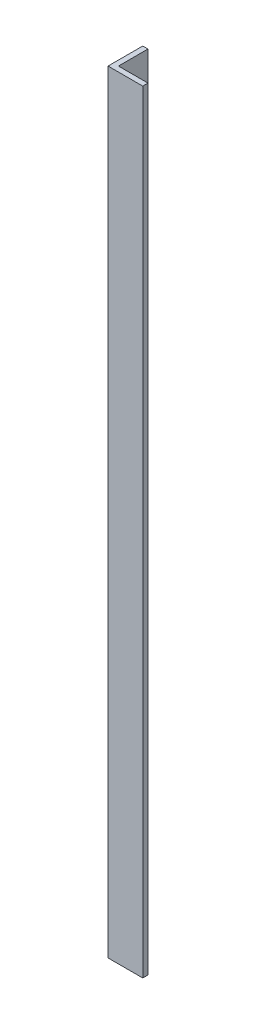
ISO-10303-21;
HEADER;
FILE_DESCRIPTION(('STEP AP214'),'2;1');
FILE_NAME('part.step','',(''),(''),'','','');
FILE_SCHEMA(('AUTOMOTIVE_DESIGN { 1 0 10303 214 1 1 1 1 }'));
ENDSEC;
DATA;
#1=APPLICATION_CONTEXT('core data for automotive mechanical design processes');
#2=APPLICATION_PROTOCOL_DEFINITION('international standard','automotive_design',2000,#1);
#3=PRODUCT_CONTEXT('',#1,'mechanical');
#4=PRODUCT('Part','Part','',(#3));
#5=PRODUCT_RELATED_PRODUCT_CATEGORY('part','',(#4));
#6=PRODUCT_DEFINITION_FORMATION('','',#4);
#7=PRODUCT_DEFINITION_CONTEXT('part definition',#1,'design');
#8=PRODUCT_DEFINITION('design','',#6,#7);
#9=PRODUCT_DEFINITION_SHAPE('','',#8);
#10=(LENGTH_UNIT() NAMED_UNIT(*) SI_UNIT(.MILLI.,.METRE.));
#11=(NAMED_UNIT(*) PLANE_ANGLE_UNIT() SI_UNIT($,.RADIAN.));
#12=(NAMED_UNIT(*) SI_UNIT($,.STERADIAN.) SOLID_ANGLE_UNIT());
#13=UNCERTAINTY_MEASURE_WITH_UNIT(LENGTH_MEASURE(1.E-05),#10,'distance_accuracy_value','');
#14=(GEOMETRIC_REPRESENTATION_CONTEXT(3) GLOBAL_UNCERTAINTY_ASSIGNED_CONTEXT((#13)) GLOBAL_UNIT_ASSIGNED_CONTEXT((#10,
#11,#12)) REPRESENTATION_CONTEXT('',''));
#15=CARTESIAN_POINT('',(0.,0.,0.));
#16=DIRECTION('',(0.,0.,1.));
#17=DIRECTION('',(1.,0.,0.));
#18=AXIS2_PLACEMENT_3D('',#15,#16,#17);
#19=CARTESIAN_POINT('',(0.,1130.3,-2.44249065417534E-12));
#20=DIRECTION('',(0.,0.,-1.));
#21=DIRECTION('',(-1.,0.,0.));
#22=AXIS2_PLACEMENT_3D('',#19,#20,#21);
#23=PLANE('',#22);
#24=DIRECTION('',(1.,0.,0.));
#25=VECTOR('',#24,1.);
#26=CARTESIAN_POINT('',(0.,0.,0.));
#27=LINE('',#26,#25);
#28=CARTESIAN_POINT('',(0.,0.,0.));
#29=VERTEX_POINT('',#28);
#30=CARTESIAN_POINT('',(50.8000000000002,0.,0.));
#31=VERTEX_POINT('',#30);
#32=EDGE_CURVE('E118',#29,#31,#27,.T.);
#33=ORIENTED_EDGE('',*,*,#32,.T.);
#34=DIRECTION('',(0.,-0.999999999999997,0.));
#35=VECTOR('',#34,1.);
#36=CARTESIAN_POINT('',(50.8000000000002,1130.3,-2.44249065417534E-12));
#37=LINE('',#36,#35);
#38=CARTESIAN_POINT('',(50.8000000000002,1130.3,-2.44249065417534E-12));
#39=VERTEX_POINT('',#38);
#40=EDGE_CURVE('E11',#39,#31,#37,.T.);
#41=ORIENTED_EDGE('',*,*,#40,.F.);
#42=DIRECTION('',(1.,0.,0.));
#43=VECTOR('',#42,1.);
#44=CARTESIAN_POINT('',(0.,1130.3,-2.44249065417534E-12));
#45=LINE('',#44,#43);
#46=CARTESIAN_POINT('',(0.,1130.3,-2.44249065417534E-12));
#47=VERTEX_POINT('',#46);
#48=EDGE_CURVE('E128',#47,#39,#45,.T.);
#49=ORIENTED_EDGE('',*,*,#48,.F.);
#50=DIRECTION('',(0.,-0.999999999999997,0.));
#51=VECTOR('',#50,1.);
#52=CARTESIAN_POINT('',(0.,1130.3,-2.44249065417534E-12));
#53=LINE('',#52,#51);
#54=EDGE_CURVE('E114',#47,#29,#53,.T.);
#55=ORIENTED_EDGE('',*,*,#54,.T.);
#56=EDGE_LOOP('',(#33,#41,#49,#55));
#57=FACE_BOUND('',#56,.T.);
#58=ADVANCED_FACE('F34',(#57),#23,.F.);
#59=CARTESIAN_POINT('',(50.8000000000002,1130.3,-2.44249065417534E-12));
#60=DIRECTION('',(-1.,0.,0.));
#61=DIRECTION('',(0.,0.,1.));
#62=AXIS2_PLACEMENT_3D('',#59,#60,#61);
#63=PLANE('',#62);
#64=DIRECTION('',(0.,0.,-1.));
#65=VECTOR('',#64,1.);
#66=CARTESIAN_POINT('',(50.8000000000002,0.,0.));
#67=LINE('',#66,#65);
#68=CARTESIAN_POINT('',(50.8000000000002,0.,-7.62000000000018));
#69=VERTEX_POINT('',#68);
#70=EDGE_CURVE('E121',#31,#69,#67,.T.);
#71=ORIENTED_EDGE('',*,*,#70,.T.);
#72=DIRECTION('',(0.,-0.999999999999997,0.));
#73=VECTOR('',#72,1.);
#74=CARTESIAN_POINT('',(50.8000000000002,1130.3,-7.62000000000262));
#75=LINE('',#74,#73);
#76=CARTESIAN_POINT('',(50.8000000000002,1130.3,-7.62000000000262));
#77=VERTEX_POINT('',#76);
#78=EDGE_CURVE('E42',#77,#69,#75,.T.);
#79=ORIENTED_EDGE('',*,*,#78,.F.);
#80=DIRECTION('',(0.,0.,-1.));
#81=VECTOR('',#80,1.);
#82=CARTESIAN_POINT('',(50.8000000000002,1130.3,-2.44249065417534E-12));
#83=LINE('',#82,#81);
#84=EDGE_CURVE('E87',#39,#77,#83,.T.);
#85=ORIENTED_EDGE('',*,*,#84,.F.);
#86=ORIENTED_EDGE('',*,*,#40,.T.);
#87=EDGE_LOOP('',(#71,#79,#85,#86));
#88=FACE_BOUND('',#87,.T.);
#89=ADVANCED_FACE('F152',(#88),#63,.F.);
#90=CARTESIAN_POINT('',(7.62000000000018,1130.3,-7.62000000000262));
#91=DIRECTION('',(0.,0.,1.));
#92=DIRECTION('',(1.,0.,0.));
#93=AXIS2_PLACEMENT_3D('',#90,#91,#92);
#94=PLANE('',#93);
#95=DIRECTION('',(-1.,0.,0.));
#96=VECTOR('',#95,1.);
#97=CARTESIAN_POINT('',(7.62000000000018,0.,-7.62000000000018));
#98=LINE('',#97,#96);
#99=CARTESIAN_POINT('',(7.62000000000018,0.,-7.62000000000018));
#100=VERTEX_POINT('',#99);
#101=EDGE_CURVE('E123',#69,#100,#98,.T.);
#102=ORIENTED_EDGE('',*,*,#101,.T.);
#103=DIRECTION('',(0.,-0.999999999999997,0.));
#104=VECTOR('',#103,1.);
#105=CARTESIAN_POINT('',(7.62000000000018,1130.3,-7.62000000000262));
#106=LINE('',#105,#104);
#107=CARTESIAN_POINT('',(7.62000000000018,1130.3,-7.62000000000262));
#108=VERTEX_POINT('',#107);
#109=EDGE_CURVE('E109',#108,#100,#106,.T.);
#110=ORIENTED_EDGE('',*,*,#109,.F.);
#111=DIRECTION('',(-1.,0.,0.));
#112=VECTOR('',#111,1.);
#113=CARTESIAN_POINT('',(7.62000000000018,1130.3,-7.62000000000262));
#114=LINE('',#113,#112);
#115=EDGE_CURVE('E100',#77,#108,#114,.T.);
#116=ORIENTED_EDGE('',*,*,#115,.F.);
#117=ORIENTED_EDGE('',*,*,#78,.T.);
#118=EDGE_LOOP('',(#102,#110,#116,#117));
#119=FACE_BOUND('',#118,.T.);
#120=ADVANCED_FACE('F134',(#119),#94,.F.);
#121=CARTESIAN_POINT('',(7.62000000000018,1130.3,-7.62000000000262));
#122=DIRECTION('',(-1.,0.,0.));
#123=DIRECTION('',(0.,0.,1.));
#124=AXIS2_PLACEMENT_3D('',#121,#122,#123);
#125=PLANE('',#124);
#126=DIRECTION('',(0.,0.,-1.));
#127=VECTOR('',#126,1.);
#128=CARTESIAN_POINT('',(7.62000000000018,0.,-7.62000000000018));
#129=LINE('',#128,#127);
#130=CARTESIAN_POINT('',(7.62000000000018,0.,-50.8000000000002));
#131=VERTEX_POINT('',#130);
#132=EDGE_CURVE('E108',#100,#131,#129,.T.);
#133=ORIENTED_EDGE('',*,*,#132,.T.);
#134=DIRECTION('',(0.,-0.999999999999997,0.));
#135=VECTOR('',#134,1.);
#136=CARTESIAN_POINT('',(7.62000000000018,1130.3,-50.8000000000026));
#137=LINE('',#136,#135);
#138=CARTESIAN_POINT('',(7.62000000000018,1130.3,-50.8000000000026));
#139=VERTEX_POINT('',#138);
#140=EDGE_CURVE('E105',#139,#131,#137,.T.);
#141=ORIENTED_EDGE('',*,*,#140,.F.);
#142=DIRECTION('',(0.,0.,-1.));
#143=VECTOR('',#142,1.);
#144=CARTESIAN_POINT('',(7.62000000000018,1130.3,-7.62000000000262));
#145=LINE('',#144,#143);
#146=EDGE_CURVE('E94',#108,#139,#145,.T.);
#147=ORIENTED_EDGE('',*,*,#146,.F.);
#148=ORIENTED_EDGE('',*,*,#109,.T.);
#149=EDGE_LOOP('',(#133,#141,#147,#148));
#150=FACE_BOUND('',#149,.T.);
#151=ADVANCED_FACE('F106',(#150),#125,.F.);
#152=CARTESIAN_POINT('',(0.,1130.3,-50.8000000000026));
#153=DIRECTION('',(0.,0.,1.));
#154=DIRECTION('',(1.,0.,0.));
#155=AXIS2_PLACEMENT_3D('',#152,#153,#154);
#156=PLANE('',#155);
#157=DIRECTION('',(-1.,0.,0.));
#158=VECTOR('',#157,1.);
#159=CARTESIAN_POINT('',(0.,0.,-50.8000000000002));
#160=LINE('',#159,#158);
#161=CARTESIAN_POINT('',(0.,0.,-50.8000000000002));
#162=VERTEX_POINT('',#161);
#163=EDGE_CURVE('E73',#131,#162,#160,.T.);
#164=ORIENTED_EDGE('',*,*,#163,.T.);
#165=DIRECTION('',(0.,-0.999999999999997,0.));
#166=VECTOR('',#165,1.);
#167=CARTESIAN_POINT('',(0.,1130.3,-50.8000000000026));
#168=LINE('',#167,#166);
#169=CARTESIAN_POINT('',(0.,1130.3,-50.8000000000026));
#170=VERTEX_POINT('',#169);
#171=EDGE_CURVE('E110',#170,#162,#168,.T.);
#172=ORIENTED_EDGE('',*,*,#171,.F.);
#173=DIRECTION('',(-1.,0.,0.));
#174=VECTOR('',#173,1.);
#175=CARTESIAN_POINT('',(0.,1130.3,-50.8000000000026));
#176=LINE('',#175,#174);
#177=EDGE_CURVE('E98',#139,#170,#176,.T.);
#178=ORIENTED_EDGE('',*,*,#177,.F.);
#179=ORIENTED_EDGE('',*,*,#140,.T.);
#180=EDGE_LOOP('',(#164,#172,#178,#179));
#181=FACE_BOUND('',#180,.T.);
#182=ADVANCED_FACE('F112',(#181),#156,.F.);
#183=CARTESIAN_POINT('',(0.,1130.3,-2.44249065417534E-12));
#184=DIRECTION('',(1.,0.,0.));
#185=DIRECTION('',(0.,0.,-1.));
#186=AXIS2_PLACEMENT_3D('',#183,#184,#185);
#187=PLANE('',#186);
#188=DIRECTION('',(0.,0.,1.));
#189=VECTOR('',#188,1.);
#190=CARTESIAN_POINT('',(0.,0.,0.));
#191=LINE('',#190,#189);
#192=EDGE_CURVE('E79',#162,#29,#191,.T.);
#193=ORIENTED_EDGE('',*,*,#192,.T.);
#194=ORIENTED_EDGE('',*,*,#54,.F.);
#195=DIRECTION('',(0.,0.,1.));
#196=VECTOR('',#195,1.);
#197=CARTESIAN_POINT('',(0.,1130.3,-2.44249065417534E-12));
#198=LINE('',#197,#196);
#199=EDGE_CURVE('E50',#170,#47,#198,.T.);
#200=ORIENTED_EDGE('',*,*,#199,.F.);
#201=ORIENTED_EDGE('',*,*,#171,.T.);
#202=EDGE_LOOP('',(#193,#194,#200,#201));
#203=FACE_BOUND('',#202,.T.);
#204=ADVANCED_FACE('F141',(#203),#187,.F.);
#205=CARTESIAN_POINT('',(0.,1130.3,-2.44249065417534E-12));
#206=DIRECTION('',(0.,0.999999999999997,0.));
#207=DIRECTION('',(0.,0.,1.));
#208=AXIS2_PLACEMENT_3D('',#205,#206,#207);
#209=PLANE('',#208);
#210=ORIENTED_EDGE('',*,*,#48,.T.);
#211=ORIENTED_EDGE('',*,*,#84,.T.);
#212=ORIENTED_EDGE('',*,*,#115,.T.);
#213=ORIENTED_EDGE('',*,*,#146,.T.);
#214=ORIENTED_EDGE('',*,*,#177,.T.);
#215=ORIENTED_EDGE('',*,*,#199,.T.);
#216=EDGE_LOOP('',(#210,#211,#212,#213,#214,#215));
#217=FACE_BOUND('',#216,.T.);
#218=ADVANCED_FACE('F96',(#217),#209,.T.);
#219=CARTESIAN_POINT('',(0.,0.,0.));
#220=DIRECTION('',(0.,0.999999999999997,0.));
#221=DIRECTION('',(0.,0.,1.));
#222=AXIS2_PLACEMENT_3D('',#219,#220,#221);
#223=PLANE('',#222);
#224=ORIENTED_EDGE('',*,*,#32,.F.);
#225=ORIENTED_EDGE('',*,*,#192,.F.);
#226=ORIENTED_EDGE('',*,*,#163,.F.);
#227=ORIENTED_EDGE('',*,*,#132,.F.);
#228=ORIENTED_EDGE('',*,*,#101,.F.);
#229=ORIENTED_EDGE('',*,*,#70,.F.);
#230=EDGE_LOOP('',(#224,#225,#226,#227,#228,#229));
#231=FACE_BOUND('',#230,.T.);
#232=ADVANCED_FACE('F137',(#231),#223,.F.);
#233=CLOSED_SHELL('',(#58,#89,#120,#151,#182,#204,#218,#232));
#234=MANIFOLD_SOLID_BREP('B2',#233);
#235=ADVANCED_BREP_SHAPE_REPRESENTATION('',(#18,#234),#14);
#236=SHAPE_DEFINITION_REPRESENTATION(#9,#235);
ENDSEC;
END-ISO-10303-21;
